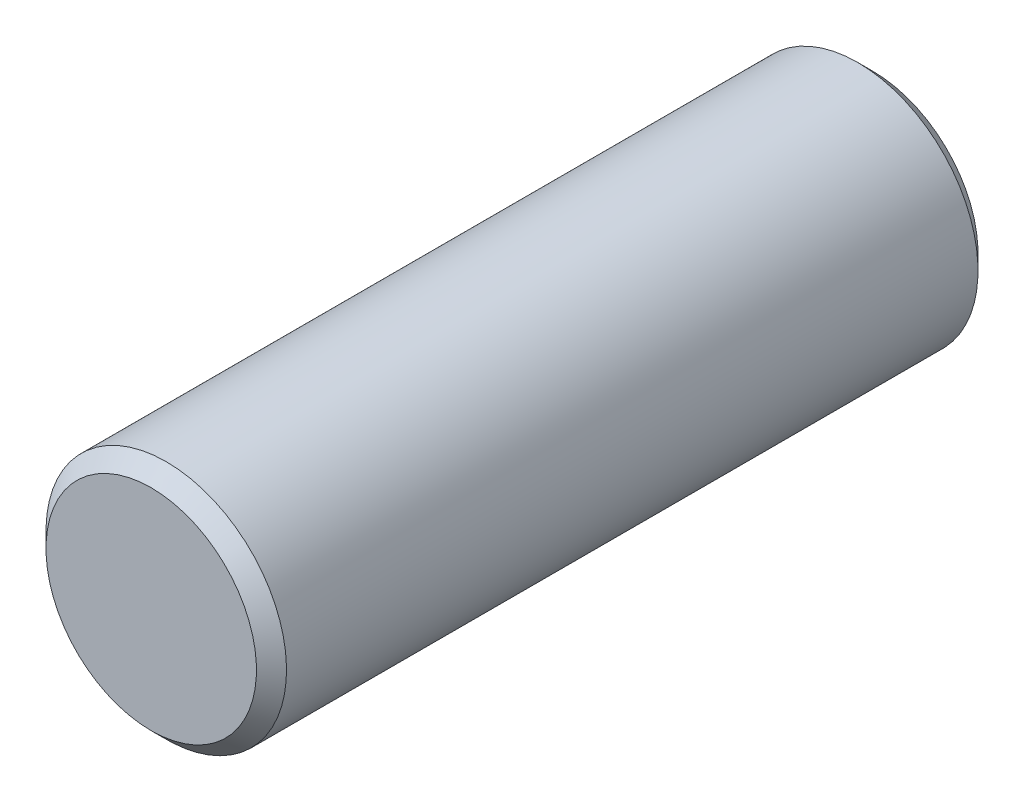
ISO-10303-21;
HEADER;
FILE_DESCRIPTION(('STEP AP214'),'2;1');
FILE_NAME('part.step','',(''),(''),'','','');
FILE_SCHEMA(('AUTOMOTIVE_DESIGN { 1 0 10303 214 1 1 1 1 }'));
ENDSEC;
DATA;
#1=APPLICATION_CONTEXT('core data for automotive mechanical design processes');
#2=APPLICATION_PROTOCOL_DEFINITION('international standard','automotive_design',2000,#1);
#3=PRODUCT_CONTEXT('',#1,'mechanical');
#4=PRODUCT('Part','Part','',(#3));
#5=PRODUCT_RELATED_PRODUCT_CATEGORY('part','',(#4));
#6=PRODUCT_DEFINITION_FORMATION('','',#4);
#7=PRODUCT_DEFINITION_CONTEXT('part definition',#1,'design');
#8=PRODUCT_DEFINITION('design','',#6,#7);
#9=PRODUCT_DEFINITION_SHAPE('','',#8);
#10=(LENGTH_UNIT() NAMED_UNIT(*) SI_UNIT(.MILLI.,.METRE.));
#11=(NAMED_UNIT(*) PLANE_ANGLE_UNIT() SI_UNIT($,.RADIAN.));
#12=(NAMED_UNIT(*) SI_UNIT($,.STERADIAN.) SOLID_ANGLE_UNIT());
#13=UNCERTAINTY_MEASURE_WITH_UNIT(LENGTH_MEASURE(1.E-05),#10,'distance_accuracy_value','');
#14=(GEOMETRIC_REPRESENTATION_CONTEXT(3) GLOBAL_UNCERTAINTY_ASSIGNED_CONTEXT((#13)) GLOBAL_UNIT_ASSIGNED_CONTEXT((#10,
#11,#12)) REPRESENTATION_CONTEXT('',''));
#15=CARTESIAN_POINT('',(0.,0.,0.));
#16=DIRECTION('',(0.,0.,1.));
#17=DIRECTION('',(1.,0.,0.));
#18=AXIS2_PLACEMENT_3D('',#15,#16,#17);
#19=CARTESIAN_POINT('',(0.,0.,5.99999999999999));
#20=DIRECTION('',(0.,0.,1.));
#21=DIRECTION('',(0.,-1.,0.));
#22=AXIS2_PLACEMENT_3D('',#19,#20,#21);
#23=PLANE('',#22);
#24=CARTESIAN_POINT('',(0.,0.,6.00000000002865));
#25=DIRECTION('',(0.,0.,-1.));
#26=DIRECTION('',(0.,1.,0.));
#27=AXIS2_PLACEMENT_3D('',#24,#25,#26);
#28=CIRCLE('',#27,1.74999999995861);
#29=CARTESIAN_POINT('',(0.,1.7499999999586,6.00000000002865));
#30=VERTEX_POINT('',#29);
#31=EDGE_CURVE('E17',#30,#30,#28,.T.);
#32=ORIENTED_EDGE('',*,*,#31,.F.);
#33=EDGE_LOOP('',(#32));
#34=FACE_BOUND('',#33,.T.);
#35=ADVANCED_FACE('F14',(#34),#23,.T.);
#36=CARTESIAN_POINT('',(0.,0.,-5.99999999999998));
#37=DIRECTION('',(0.,0.,1.));
#38=DIRECTION('',(0.,-1.,0.));
#39=AXIS2_PLACEMENT_3D('',#36,#37,#38);
#40=PLANE('',#39);
#41=CARTESIAN_POINT('',(0.,0.,-6.00000000002865));
#42=DIRECTION('',(0.,0.,1.));
#43=DIRECTION('',(0.,-1.,0.));
#44=AXIS2_PLACEMENT_3D('',#41,#42,#43);
#45=CIRCLE('',#44,1.75000000001546);
#46=CARTESIAN_POINT('',(0.,-1.75000000001548,-6.00000000002865));
#47=VERTEX_POINT('',#46);
#48=EDGE_CURVE('E26',#47,#47,#45,.T.);
#49=ORIENTED_EDGE('',*,*,#48,.F.);
#50=EDGE_LOOP('',(#49));
#51=FACE_BOUND('',#50,.T.);
#52=ADVANCED_FACE('F37',(#51),#40,.F.);
#53=CARTESIAN_POINT('',(0.,0.,5.7500000000914));
#54=DIRECTION('',(0.,0.,-1.));
#55=DIRECTION('',(0.,1.,0.));
#56=AXIS2_PLACEMENT_3D('',#53,#54,#55);
#57=CONICAL_SURFACE('',#56,1.99999999989586,0.785398163397448);
#58=CARTESIAN_POINT('',(0.,0.,5.74999999999999));
#59=DIRECTION('',(0.,0.,-1.));
#60=DIRECTION('',(0.,1.,0.));
#61=AXIS2_PLACEMENT_3D('',#58,#59,#60);
#62=CIRCLE('',#61,2.00000000000002);
#63=CARTESIAN_POINT('',(0.,2.,5.74999999999999));
#64=VERTEX_POINT('',#63);
#65=EDGE_CURVE('E21',#64,#64,#62,.T.);
#66=ORIENTED_EDGE('',*,*,#65,.F.);
#67=EDGE_LOOP('',(#66));
#68=FACE_BOUND('',#67,.T.);
#69=ORIENTED_EDGE('',*,*,#31,.T.);
#70=EDGE_LOOP('',(#69));
#71=FACE_BOUND('',#70,.T.);
#72=ADVANCED_FACE('F34',(#68,#71),#57,.T.);
#73=CARTESIAN_POINT('',(0.,0.,-5.7500000000914));
#74=DIRECTION('',(0.,0.,1.));
#75=DIRECTION('',(0.,-1.,0.));
#76=AXIS2_PLACEMENT_3D('',#73,#74,#75);
#77=CONICAL_SURFACE('',#76,1.99999999989586,0.785398163283761);
#78=CARTESIAN_POINT('',(0.,0.,-5.74999999999998));
#79=DIRECTION('',(0.,0.,-1.));
#80=DIRECTION('',(0.,1.,0.));
#81=AXIS2_PLACEMENT_3D('',#78,#79,#80);
#82=CIRCLE('',#81,2.00000000000002);
#83=CARTESIAN_POINT('',(0.,2.,-5.74999999999998));
#84=VERTEX_POINT('',#83);
#85=EDGE_CURVE('E10',#84,#84,#82,.F.);
#86=ORIENTED_EDGE('',*,*,#85,.F.);
#87=EDGE_LOOP('',(#86));
#88=FACE_BOUND('',#87,.T.);
#89=ORIENTED_EDGE('',*,*,#48,.T.);
#90=EDGE_LOOP('',(#89));
#91=FACE_BOUND('',#90,.T.);
#92=ADVANCED_FACE('F45',(#88,#91),#77,.T.);
#93=CARTESIAN_POINT('',(0.,0.,5.99999999999999));
#94=DIRECTION('',(0.,0.,-1.));
#95=DIRECTION('',(0.,1.,0.));
#96=AXIS2_PLACEMENT_3D('',#93,#94,#95);
#97=CYLINDRICAL_SURFACE('',#96,2.00000000000002);
#98=ORIENTED_EDGE('',*,*,#85,.T.);
#99=EDGE_LOOP('',(#98));
#100=FACE_BOUND('',#99,.T.);
#101=ORIENTED_EDGE('',*,*,#65,.T.);
#102=EDGE_LOOP('',(#101));
#103=FACE_BOUND('',#102,.T.);
#104=ADVANCED_FACE('F43',(#100,#103),#97,.T.);
#105=CLOSED_SHELL('',(#35,#52,#72,#92,#104));
#106=MANIFOLD_SOLID_BREP('B1',#105);
#107=ADVANCED_BREP_SHAPE_REPRESENTATION('',(#18,#106),#14);
#108=SHAPE_DEFINITION_REPRESENTATION(#9,#107);
ENDSEC;
END-ISO-10303-21;
